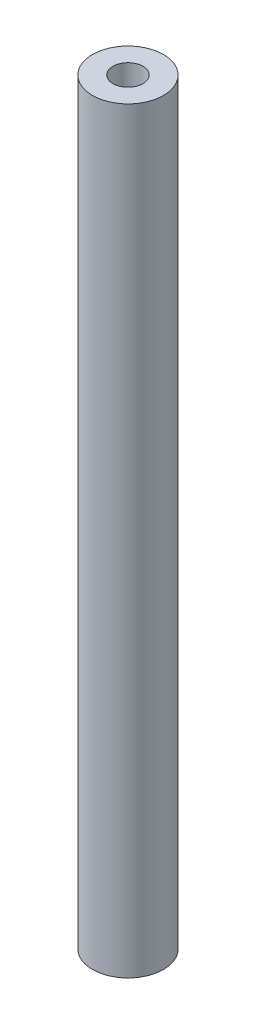
ISO-10303-21;
HEADER;
FILE_DESCRIPTION(('STEP AP214'),'2;1');
FILE_NAME('part.step','',(''),(''),'','','');
FILE_SCHEMA(('AUTOMOTIVE_DESIGN { 1 0 10303 214 1 1 1 1 }'));
ENDSEC;
DATA;
#1=APPLICATION_CONTEXT('core data for automotive mechanical design processes');
#2=APPLICATION_PROTOCOL_DEFINITION('international standard','automotive_design',2000,#1);
#3=PRODUCT_CONTEXT('',#1,'mechanical');
#4=PRODUCT('Part','Part','',(#3));
#5=PRODUCT_RELATED_PRODUCT_CATEGORY('part','',(#4));
#6=PRODUCT_DEFINITION_FORMATION('','',#4);
#7=PRODUCT_DEFINITION_CONTEXT('part definition',#1,'design');
#8=PRODUCT_DEFINITION('design','',#6,#7);
#9=PRODUCT_DEFINITION_SHAPE('','',#8);
#10=(LENGTH_UNIT() NAMED_UNIT(*) SI_UNIT(.MILLI.,.METRE.));
#11=(NAMED_UNIT(*) PLANE_ANGLE_UNIT() SI_UNIT($,.RADIAN.));
#12=(NAMED_UNIT(*) SI_UNIT($,.STERADIAN.) SOLID_ANGLE_UNIT());
#13=UNCERTAINTY_MEASURE_WITH_UNIT(LENGTH_MEASURE(1.E-05),#10,'distance_accuracy_value','');
#14=(GEOMETRIC_REPRESENTATION_CONTEXT(3) GLOBAL_UNCERTAINTY_ASSIGNED_CONTEXT((#13)) GLOBAL_UNIT_ASSIGNED_CONTEXT((#10,
#11,#12)) REPRESENTATION_CONTEXT('',''));
#15=CARTESIAN_POINT('',(0.,0.,0.));
#16=DIRECTION('',(0.,0.,1.));
#17=DIRECTION('',(1.,0.,0.));
#18=AXIS2_PLACEMENT_3D('',#15,#16,#17);
#19=CARTESIAN_POINT('',(0.,50.8,0.));
#20=DIRECTION('',(0.,-1.,0.));
#21=DIRECTION('',(0.,0.,-1.));
#22=AXIS2_PLACEMENT_3D('',#19,#20,#21);
#23=CYLINDRICAL_SURFACE('',#22,4.7625);
#24=CARTESIAN_POINT('',(0.,50.8,0.));
#25=DIRECTION('',(0.,1.,0.));
#26=DIRECTION('',(0.,0.,1.));
#27=AXIS2_PLACEMENT_3D('',#24,#25,#26);
#28=CIRCLE('',#27,4.7625);
#29=CARTESIAN_POINT('',(0.,50.8,4.7625));
#30=VERTEX_POINT('',#29);
#31=EDGE_CURVE('E11',#30,#30,#28,.T.);
#32=ORIENTED_EDGE('',*,*,#31,.F.);
#33=EDGE_LOOP('',(#32));
#34=FACE_BOUND('',#33,.T.);
#35=CARTESIAN_POINT('',(0.,-50.8,0.));
#36=DIRECTION('',(0.,1.,0.));
#37=DIRECTION('',(0.,0.,1.));
#38=AXIS2_PLACEMENT_3D('',#35,#36,#37);
#39=CIRCLE('',#38,4.7625);
#40=CARTESIAN_POINT('',(0.,-50.8,4.7625));
#41=VERTEX_POINT('',#40);
#42=EDGE_CURVE('E44',#41,#41,#39,.T.);
#43=ORIENTED_EDGE('',*,*,#42,.T.);
#44=EDGE_LOOP('',(#43));
#45=FACE_BOUND('',#44,.T.);
#46=ADVANCED_FACE('F41',(#34,#45),#23,.T.);
#47=CARTESIAN_POINT('',(0.,50.8,0.));
#48=DIRECTION('',(0.,1.,0.));
#49=DIRECTION('',(0.,0.,1.));
#50=AXIS2_PLACEMENT_3D('',#47,#48,#49);
#51=PLANE('',#50);
#52=CARTESIAN_POINT('',(0.,50.8,0.));
#53=DIRECTION('',(0.,1.,0.));
#54=DIRECTION('',(0.,0.,1.));
#55=AXIS2_PLACEMENT_3D('',#52,#53,#54);
#56=CIRCLE('',#55,2.01929999999999);
#57=CARTESIAN_POINT('',(0.,50.8,2.01929999999999));
#58=VERTEX_POINT('',#57);
#59=EDGE_CURVE('E65',#58,#58,#56,.T.);
#60=ORIENTED_EDGE('',*,*,#59,.F.);
#61=EDGE_LOOP('',(#60));
#62=FACE_BOUND('',#61,.T.);
#63=ORIENTED_EDGE('',*,*,#31,.T.);
#64=EDGE_LOOP('',(#63));
#65=FACE_BOUND('',#64,.T.);
#66=ADVANCED_FACE('F83',(#62,#65),#51,.T.);
#67=CARTESIAN_POINT('',(0.,-50.8,0.));
#68=DIRECTION('',(0.,1.,0.));
#69=DIRECTION('',(0.,0.,1.));
#70=AXIS2_PLACEMENT_3D('',#67,#68,#69);
#71=PLANE('',#70);
#72=CARTESIAN_POINT('',(0.,-50.8,0.));
#73=DIRECTION('',(0.,-1.,0.));
#74=DIRECTION('',(0.,0.,-1.));
#75=AXIS2_PLACEMENT_3D('',#72,#73,#74);
#76=CIRCLE('',#75,2.01929999999999);
#77=CARTESIAN_POINT('',(0.,-50.8,-2.01929999999999));
#78=VERTEX_POINT('',#77);
#79=EDGE_CURVE('E64',#78,#78,#76,.T.);
#80=ORIENTED_EDGE('',*,*,#79,.F.);
#81=EDGE_LOOP('',(#80));
#82=FACE_BOUND('',#81,.T.);
#83=ORIENTED_EDGE('',*,*,#42,.F.);
#84=EDGE_LOOP('',(#83));
#85=FACE_BOUND('',#84,.T.);
#86=ADVANCED_FACE('F80',(#82,#85),#71,.F.);
#87=CARTESIAN_POINT('',(0.,-38.862,0.));
#88=DIRECTION('',(0.,-1.,0.));
#89=DIRECTION('',(0.,0.,-1.));
#90=AXIS2_PLACEMENT_3D('',#87,#88,#89);
#91=CONICAL_SURFACE('',#90,2.01929999999999,1.02974425867665);
#92=CARTESIAN_POINT('',(0.,-37.6486821519976,0.));
#93=VERTEX_POINT('',#92);
#94=VERTEX_LOOP('',#93);
#95=FACE_BOUND('',#94,.T.);
#96=CARTESIAN_POINT('',(0.,-38.862,0.));
#97=DIRECTION('',(0.,-1.,0.));
#98=DIRECTION('',(0.,0.,-1.));
#99=AXIS2_PLACEMENT_3D('',#96,#97,#98);
#100=CIRCLE('',#99,2.01929999999999);
#101=CARTESIAN_POINT('',(0.,-38.862,-2.01929999999999));
#102=VERTEX_POINT('',#101);
#103=EDGE_CURVE('E68',#102,#102,#100,.T.);
#104=ORIENTED_EDGE('',*,*,#103,.T.);
#105=EDGE_LOOP('',(#104));
#106=FACE_BOUND('',#105,.T.);
#107=ADVANCED_FACE('F82',(#95,#106),#91,.F.);
#108=CARTESIAN_POINT('',(0.,-50.8,0.));
#109=DIRECTION('',(0.,-1.,0.));
#110=DIRECTION('',(0.,0.,-1.));
#111=AXIS2_PLACEMENT_3D('',#108,#109,#110);
#112=CYLINDRICAL_SURFACE('',#111,2.01929999999999);
#113=ORIENTED_EDGE('',*,*,#103,.F.);
#114=EDGE_LOOP('',(#113));
#115=FACE_BOUND('',#114,.T.);
#116=ORIENTED_EDGE('',*,*,#79,.T.);
#117=EDGE_LOOP('',(#116));
#118=FACE_BOUND('',#117,.T.);
#119=ADVANCED_FACE('F58',(#115,#118),#112,.F.);
#120=CARTESIAN_POINT('',(0.,38.862,0.));
#121=DIRECTION('',(0.,1.,0.));
#122=DIRECTION('',(0.,0.,1.));
#123=AXIS2_PLACEMENT_3D('',#120,#121,#122);
#124=CONICAL_SURFACE('',#123,2.01929999999999,1.02974425867665);
#125=CARTESIAN_POINT('',(0.,37.6486821519976,0.));
#126=VERTEX_POINT('',#125);
#127=VERTEX_LOOP('',#126);
#128=FACE_BOUND('',#127,.T.);
#129=CARTESIAN_POINT('',(0.,38.862,0.));
#130=DIRECTION('',(0.,1.,0.));
#131=DIRECTION('',(0.,0.,1.));
#132=AXIS2_PLACEMENT_3D('',#129,#130,#131);
#133=CIRCLE('',#132,2.01929999999999);
#134=CARTESIAN_POINT('',(0.,38.862,2.01929999999999));
#135=VERTEX_POINT('',#134);
#136=EDGE_CURVE('E62',#135,#135,#133,.T.);
#137=ORIENTED_EDGE('',*,*,#136,.T.);
#138=EDGE_LOOP('',(#137));
#139=FACE_BOUND('',#138,.T.);
#140=ADVANCED_FACE('F54',(#128,#139),#124,.F.);
#141=CARTESIAN_POINT('',(0.,50.8,0.));
#142=DIRECTION('',(0.,1.,0.));
#143=DIRECTION('',(0.,0.,1.));
#144=AXIS2_PLACEMENT_3D('',#141,#142,#143);
#145=CYLINDRICAL_SURFACE('',#144,2.01929999999999);
#146=ORIENTED_EDGE('',*,*,#136,.F.);
#147=EDGE_LOOP('',(#146));
#148=FACE_BOUND('',#147,.T.);
#149=ORIENTED_EDGE('',*,*,#59,.T.);
#150=EDGE_LOOP('',(#149));
#151=FACE_BOUND('',#150,.T.);
#152=ADVANCED_FACE('F57',(#148,#151),#145,.F.);
#153=CLOSED_SHELL('',(#46,#66,#86,#107,#119,#140,#152));
#154=MANIFOLD_SOLID_BREP('B2',#153);
#155=ADVANCED_BREP_SHAPE_REPRESENTATION('',(#18,#154),#14);
#156=SHAPE_DEFINITION_REPRESENTATION(#9,#155);
ENDSEC;
END-ISO-10303-21;
